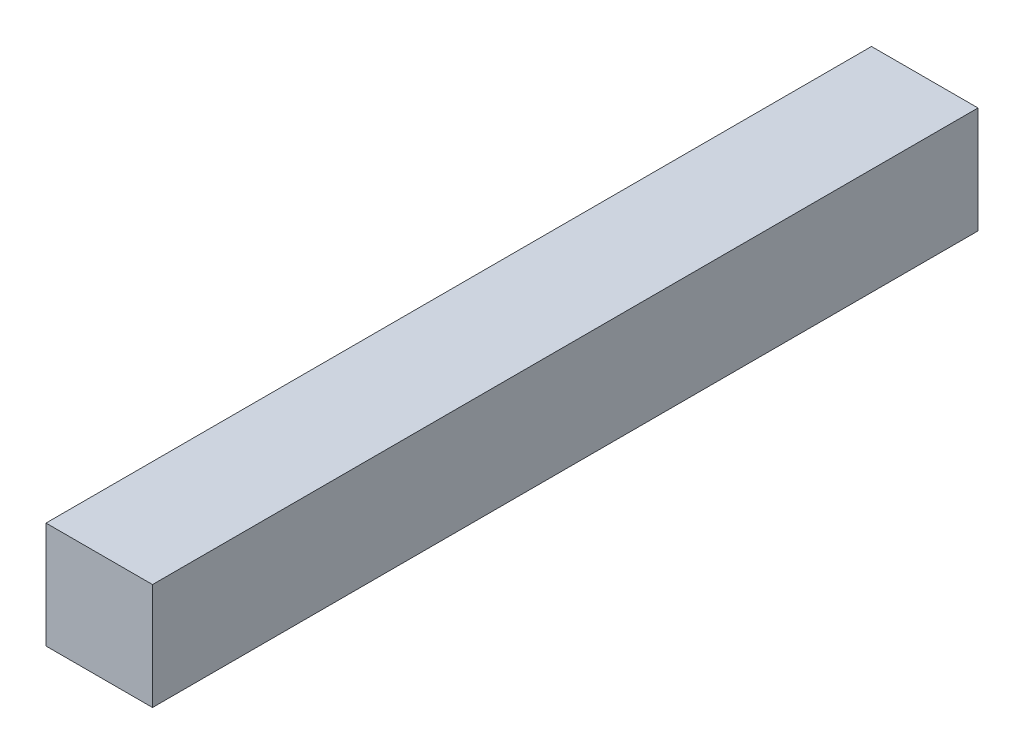
ISO-10303-21;
HEADER;
FILE_DESCRIPTION(('STEP AP214'),'2;1');
FILE_NAME('part.step','',(''),(''),'','','');
FILE_SCHEMA(('AUTOMOTIVE_DESIGN { 1 0 10303 214 1 1 1 1 }'));
ENDSEC;
DATA;
#1=APPLICATION_CONTEXT('core data for automotive mechanical design processes');
#2=APPLICATION_PROTOCOL_DEFINITION('international standard','automotive_design',2000,#1);
#3=PRODUCT_CONTEXT('',#1,'mechanical');
#4=PRODUCT('Part','Part','',(#3));
#5=PRODUCT_RELATED_PRODUCT_CATEGORY('part','',(#4));
#6=PRODUCT_DEFINITION_FORMATION('','',#4);
#7=PRODUCT_DEFINITION_CONTEXT('part definition',#1,'design');
#8=PRODUCT_DEFINITION('design','',#6,#7);
#9=PRODUCT_DEFINITION_SHAPE('','',#8);
#10=(LENGTH_UNIT() NAMED_UNIT(*) SI_UNIT(.MILLI.,.METRE.));
#11=(NAMED_UNIT(*) PLANE_ANGLE_UNIT() SI_UNIT($,.RADIAN.));
#12=(NAMED_UNIT(*) SI_UNIT($,.STERADIAN.) SOLID_ANGLE_UNIT());
#13=UNCERTAINTY_MEASURE_WITH_UNIT(LENGTH_MEASURE(1.E-05),#10,'distance_accuracy_value','');
#14=(GEOMETRIC_REPRESENTATION_CONTEXT(3) GLOBAL_UNCERTAINTY_ASSIGNED_CONTEXT((#13)) GLOBAL_UNIT_ASSIGNED_CONTEXT((#10,
#11,#12)) REPRESENTATION_CONTEXT('',''));
#15=CARTESIAN_POINT('',(0.,0.,0.));
#16=DIRECTION('',(0.,0.,1.));
#17=DIRECTION('',(1.,0.,0.));
#18=AXIS2_PLACEMENT_3D('',#15,#16,#17);
#19=CARTESIAN_POINT('',(0.,0.,196.85));
#20=DIRECTION('',(1.,0.,0.));
#21=DIRECTION('',(0.,0.,-1.));
#22=AXIS2_PLACEMENT_3D('',#19,#20,#21);
#23=PLANE('',#22);
#24=DIRECTION('',(0.,-1.,0.));
#25=VECTOR('',#24,1.);
#26=CARTESIAN_POINT('',(0.,0.,0.));
#27=LINE('',#26,#25);
#28=CARTESIAN_POINT('',(0.,25.4,0.));
#29=VERTEX_POINT('',#28);
#30=CARTESIAN_POINT('',(0.,0.,0.));
#31=VERTEX_POINT('',#30);
#32=EDGE_CURVE('E95',#29,#31,#27,.T.);
#33=ORIENTED_EDGE('',*,*,#32,.T.);
#34=DIRECTION('',(0.,0.,-1.));
#35=VECTOR('',#34,1.);
#36=CARTESIAN_POINT('',(0.,0.,196.85));
#37=LINE('',#36,#35);
#38=CARTESIAN_POINT('',(0.,0.,196.85));
#39=VERTEX_POINT('',#38);
#40=EDGE_CURVE('E11',#39,#31,#37,.T.);
#41=ORIENTED_EDGE('',*,*,#40,.F.);
#42=DIRECTION('',(0.,-1.,0.));
#43=VECTOR('',#42,1.);
#44=CARTESIAN_POINT('',(0.,0.,196.85));
#45=LINE('',#44,#43);
#46=CARTESIAN_POINT('',(0.,25.4,196.85));
#47=VERTEX_POINT('',#46);
#48=EDGE_CURVE('E83',#47,#39,#45,.T.);
#49=ORIENTED_EDGE('',*,*,#48,.F.);
#50=DIRECTION('',(0.,0.,-1.));
#51=VECTOR('',#50,1.);
#52=CARTESIAN_POINT('',(0.,25.4,196.85));
#53=LINE('',#52,#51);
#54=EDGE_CURVE('E91',#47,#29,#53,.T.);
#55=ORIENTED_EDGE('',*,*,#54,.T.);
#56=EDGE_LOOP('',(#33,#41,#49,#55));
#57=FACE_BOUND('',#56,.T.);
#58=ADVANCED_FACE('F32',(#57),#23,.F.);
#59=CARTESIAN_POINT('',(0.,0.,196.85));
#60=DIRECTION('',(0.,1.,0.));
#61=DIRECTION('',(0.,0.,1.));
#62=AXIS2_PLACEMENT_3D('',#59,#60,#61);
#63=PLANE('',#62);
#64=DIRECTION('',(1.,0.,0.));
#65=VECTOR('',#64,1.);
#66=CARTESIAN_POINT('',(0.,0.,0.));
#67=LINE('',#66,#65);
#68=CARTESIAN_POINT('',(25.4,0.,0.));
#69=VERTEX_POINT('',#68);
#70=EDGE_CURVE('E87',#31,#69,#67,.T.);
#71=ORIENTED_EDGE('',*,*,#70,.T.);
#72=DIRECTION('',(0.,0.,-1.));
#73=VECTOR('',#72,1.);
#74=CARTESIAN_POINT('',(25.4,0.,196.85));
#75=LINE('',#74,#73);
#76=CARTESIAN_POINT('',(25.4,0.,196.85));
#77=VERTEX_POINT('',#76);
#78=EDGE_CURVE('E40',#77,#69,#75,.T.);
#79=ORIENTED_EDGE('',*,*,#78,.F.);
#80=DIRECTION('',(1.,0.,0.));
#81=VECTOR('',#80,1.);
#82=CARTESIAN_POINT('',(0.,0.,196.85));
#83=LINE('',#82,#81);
#84=EDGE_CURVE('E78',#39,#77,#83,.T.);
#85=ORIENTED_EDGE('',*,*,#84,.F.);
#86=ORIENTED_EDGE('',*,*,#40,.T.);
#87=EDGE_LOOP('',(#71,#79,#85,#86));
#88=FACE_BOUND('',#87,.T.);
#89=ADVANCED_FACE('F86',(#88),#63,.F.);
#90=CARTESIAN_POINT('',(25.4,0.,196.85));
#91=DIRECTION('',(-1.,0.,0.));
#92=DIRECTION('',(0.,0.,1.));
#93=AXIS2_PLACEMENT_3D('',#90,#91,#92);
#94=PLANE('',#93);
#95=DIRECTION('',(0.,1.,0.));
#96=VECTOR('',#95,1.);
#97=CARTESIAN_POINT('',(25.4,0.,0.));
#98=LINE('',#97,#96);
#99=CARTESIAN_POINT('',(25.4,25.4,0.));
#100=VERTEX_POINT('',#99);
#101=EDGE_CURVE('E65',#69,#100,#98,.T.);
#102=ORIENTED_EDGE('',*,*,#101,.T.);
#103=DIRECTION('',(0.,0.,-1.));
#104=VECTOR('',#103,1.);
#105=CARTESIAN_POINT('',(25.4,25.4,196.85));
#106=LINE('',#105,#104);
#107=CARTESIAN_POINT('',(25.4,25.4,196.85));
#108=VERTEX_POINT('',#107);
#109=EDGE_CURVE('E88',#108,#100,#106,.T.);
#110=ORIENTED_EDGE('',*,*,#109,.F.);
#111=DIRECTION('',(0.,1.,0.));
#112=VECTOR('',#111,1.);
#113=CARTESIAN_POINT('',(25.4,0.,196.85));
#114=LINE('',#113,#112);
#115=EDGE_CURVE('E81',#77,#108,#114,.T.);
#116=ORIENTED_EDGE('',*,*,#115,.F.);
#117=ORIENTED_EDGE('',*,*,#78,.T.);
#118=EDGE_LOOP('',(#102,#110,#116,#117));
#119=FACE_BOUND('',#118,.T.);
#120=ADVANCED_FACE('F89',(#119),#94,.F.);
#121=CARTESIAN_POINT('',(0.,25.4,196.85));
#122=DIRECTION('',(0.,-1.,0.));
#123=DIRECTION('',(0.,0.,-1.));
#124=AXIS2_PLACEMENT_3D('',#121,#122,#123);
#125=PLANE('',#124);
#126=DIRECTION('',(-1.,0.,0.));
#127=VECTOR('',#126,1.);
#128=CARTESIAN_POINT('',(0.,25.4,0.));
#129=LINE('',#128,#127);
#130=EDGE_CURVE('E71',#100,#29,#129,.T.);
#131=ORIENTED_EDGE('',*,*,#130,.T.);
#132=ORIENTED_EDGE('',*,*,#54,.F.);
#133=DIRECTION('',(-1.,0.,0.));
#134=VECTOR('',#133,1.);
#135=CARTESIAN_POINT('',(0.,25.4,196.85));
#136=LINE('',#135,#134);
#137=EDGE_CURVE('E48',#108,#47,#136,.T.);
#138=ORIENTED_EDGE('',*,*,#137,.F.);
#139=ORIENTED_EDGE('',*,*,#109,.T.);
#140=EDGE_LOOP('',(#131,#132,#138,#139));
#141=FACE_BOUND('',#140,.T.);
#142=ADVANCED_FACE('F102',(#141),#125,.F.);
#143=CARTESIAN_POINT('',(0.,0.,196.85));
#144=DIRECTION('',(0.,0.,-1.));
#145=DIRECTION('',(-1.,0.,0.));
#146=AXIS2_PLACEMENT_3D('',#143,#144,#145);
#147=PLANE('',#146);
#148=ORIENTED_EDGE('',*,*,#48,.T.);
#149=ORIENTED_EDGE('',*,*,#84,.T.);
#150=ORIENTED_EDGE('',*,*,#115,.T.);
#151=ORIENTED_EDGE('',*,*,#137,.T.);
#152=EDGE_LOOP('',(#148,#149,#150,#151));
#153=FACE_BOUND('',#152,.T.);
#154=ADVANCED_FACE('F79',(#153),#147,.F.);
#155=CARTESIAN_POINT('',(0.,0.,0.));
#156=DIRECTION('',(0.,0.,-1.));
#157=DIRECTION('',(-1.,0.,0.));
#158=AXIS2_PLACEMENT_3D('',#155,#156,#157);
#159=PLANE('',#158);
#160=ORIENTED_EDGE('',*,*,#32,.F.);
#161=ORIENTED_EDGE('',*,*,#130,.F.);
#162=ORIENTED_EDGE('',*,*,#101,.F.);
#163=ORIENTED_EDGE('',*,*,#70,.F.);
#164=EDGE_LOOP('',(#160,#161,#162,#163));
#165=FACE_BOUND('',#164,.T.);
#166=ADVANCED_FACE('F105',(#165),#159,.T.);
#167=CLOSED_SHELL('',(#58,#89,#120,#142,#154,#166));
#168=MANIFOLD_SOLID_BREP('B2',#167);
#169=ADVANCED_BREP_SHAPE_REPRESENTATION('',(#18,#168),#14);
#170=SHAPE_DEFINITION_REPRESENTATION(#9,#169);
ENDSEC;
END-ISO-10303-21;
